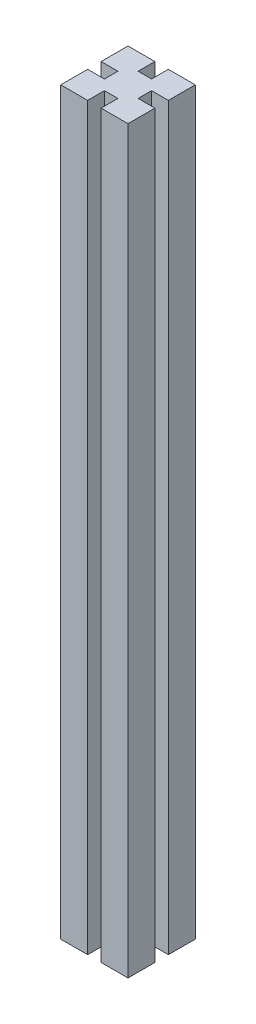
ISO-10303-21;
HEADER;
FILE_DESCRIPTION(('STEP AP214'),'2;1');
FILE_NAME('part.step','',(''),(''),'','','');
FILE_SCHEMA(('AUTOMOTIVE_DESIGN { 1 0 10303 214 1 1 1 1 }'));
ENDSEC;
DATA;
#1=APPLICATION_CONTEXT('core data for automotive mechanical design processes');
#2=APPLICATION_PROTOCOL_DEFINITION('international standard','automotive_design',2000,#1);
#3=PRODUCT_CONTEXT('',#1,'mechanical');
#4=PRODUCT('Part','Part','',(#3));
#5=PRODUCT_RELATED_PRODUCT_CATEGORY('part','',(#4));
#6=PRODUCT_DEFINITION_FORMATION('','',#4);
#7=PRODUCT_DEFINITION_CONTEXT('part definition',#1,'design');
#8=PRODUCT_DEFINITION('design','',#6,#7);
#9=PRODUCT_DEFINITION_SHAPE('','',#8);
#10=(LENGTH_UNIT() NAMED_UNIT(*) SI_UNIT(.MILLI.,.METRE.));
#11=(NAMED_UNIT(*) PLANE_ANGLE_UNIT() SI_UNIT($,.RADIAN.));
#12=(NAMED_UNIT(*) SI_UNIT($,.STERADIAN.) SOLID_ANGLE_UNIT());
#13=UNCERTAINTY_MEASURE_WITH_UNIT(LENGTH_MEASURE(1.E-05),#10,'distance_accuracy_value','');
#14=(GEOMETRIC_REPRESENTATION_CONTEXT(3) GLOBAL_UNCERTAINTY_ASSIGNED_CONTEXT((#13)) GLOBAL_UNIT_ASSIGNED_CONTEXT((#10,
#11,#12)) REPRESENTATION_CONTEXT('',''));
#15=CARTESIAN_POINT('',(0.,0.,0.));
#16=DIRECTION('',(0.,0.,1.));
#17=DIRECTION('',(1.,0.,0.));
#18=AXIS2_PLACEMENT_3D('',#15,#16,#17);
#19=CARTESIAN_POINT('',(5.00000000000001,550.,25.));
#20=DIRECTION('',(0.,0.,-1.));
#21=DIRECTION('',(-1.,0.,0.));
#22=AXIS2_PLACEMENT_3D('',#19,#20,#21);
#23=PLANE('',#22);
#24=DIRECTION('',(1.,0.,0.));
#25=VECTOR('',#24,1.);
#26=CARTESIAN_POINT('',(5.00000000000001,0.,25.));
#27=LINE('',#26,#25);
#28=CARTESIAN_POINT('',(5.00000000000001,0.,25.));
#29=VERTEX_POINT('',#28);
#30=CARTESIAN_POINT('',(25.,0.,25.));
#31=VERTEX_POINT('',#30);
#32=EDGE_CURVE('E199',#29,#31,#27,.T.);
#33=ORIENTED_EDGE('',*,*,#32,.T.);
#34=DIRECTION('',(0.,-1.,0.));
#35=VECTOR('',#34,1.);
#36=CARTESIAN_POINT('',(25.,550.,25.));
#37=LINE('',#36,#35);
#38=CARTESIAN_POINT('',(25.,550.,25.));
#39=VERTEX_POINT('',#38);
#40=EDGE_CURVE('E11',#39,#31,#37,.T.);
#41=ORIENTED_EDGE('',*,*,#40,.F.);
#42=DIRECTION('',(1.,0.,0.));
#43=VECTOR('',#42,1.);
#44=CARTESIAN_POINT('',(5.00000000000001,550.,25.));
#45=LINE('',#44,#43);
#46=CARTESIAN_POINT('',(5.00000000000001,550.,25.));
#47=VERTEX_POINT('',#46);
#48=EDGE_CURVE('E254',#47,#39,#45,.T.);
#49=ORIENTED_EDGE('',*,*,#48,.F.);
#50=DIRECTION('',(0.,-1.,0.));
#51=VECTOR('',#50,1.);
#52=CARTESIAN_POINT('',(5.00000000000001,550.,25.));
#53=LINE('',#52,#51);
#54=EDGE_CURVE('E119',#47,#29,#53,.T.);
#55=ORIENTED_EDGE('',*,*,#54,.T.);
#56=EDGE_LOOP('',(#33,#41,#49,#55));
#57=FACE_BOUND('',#56,.T.);
#58=ADVANCED_FACE('F33',(#57),#23,.F.);
#59=CARTESIAN_POINT('',(25.,550.,5.));
#60=DIRECTION('',(-1.,0.,0.));
#61=DIRECTION('',(0.,0.,1.));
#62=AXIS2_PLACEMENT_3D('',#59,#60,#61);
#63=PLANE('',#62);
#64=DIRECTION('',(0.,0.,-1.));
#65=VECTOR('',#64,1.);
#66=CARTESIAN_POINT('',(25.,0.,5.));
#67=LINE('',#66,#65);
#68=CARTESIAN_POINT('',(25.,0.,5.));
#69=VERTEX_POINT('',#68);
#70=EDGE_CURVE('E201',#31,#69,#67,.T.);
#71=ORIENTED_EDGE('',*,*,#70,.T.);
#72=DIRECTION('',(0.,-1.,0.));
#73=VECTOR('',#72,1.);
#74=CARTESIAN_POINT('',(25.,550.,5.));
#75=LINE('',#74,#73);
#76=CARTESIAN_POINT('',(25.,550.,5.));
#77=VERTEX_POINT('',#76);
#78=EDGE_CURVE('E41',#77,#69,#75,.T.);
#79=ORIENTED_EDGE('',*,*,#78,.F.);
#80=DIRECTION('',(0.,0.,-1.));
#81=VECTOR('',#80,1.);
#82=CARTESIAN_POINT('',(25.,550.,5.));
#83=LINE('',#82,#81);
#84=EDGE_CURVE('E126',#39,#77,#83,.T.);
#85=ORIENTED_EDGE('',*,*,#84,.F.);
#86=ORIENTED_EDGE('',*,*,#40,.T.);
#87=EDGE_LOOP('',(#71,#79,#85,#86));
#88=FACE_BOUND('',#87,.T.);
#89=ADVANCED_FACE('F293',(#88),#63,.F.);
#90=CARTESIAN_POINT('',(25.,550.,5.));
#91=DIRECTION('',(0.,0.,1.));
#92=DIRECTION('',(1.,0.,0.));
#93=AXIS2_PLACEMENT_3D('',#90,#91,#92);
#94=PLANE('',#93);
#95=DIRECTION('',(-1.,0.,0.));
#96=VECTOR('',#95,1.);
#97=CARTESIAN_POINT('',(25.,0.,5.));
#98=LINE('',#97,#96);
#99=CARTESIAN_POINT('',(12.5,0.,5.));
#100=VERTEX_POINT('',#99);
#101=EDGE_CURVE('E204',#69,#100,#98,.T.);
#102=ORIENTED_EDGE('',*,*,#101,.T.);
#103=DIRECTION('',(0.,-1.,0.));
#104=VECTOR('',#103,1.);
#105=CARTESIAN_POINT('',(12.5,550.,5.));
#106=LINE('',#105,#104);
#107=CARTESIAN_POINT('',(12.5,550.,5.));
#108=VERTEX_POINT('',#107);
#109=EDGE_CURVE('E284',#108,#100,#106,.T.);
#110=ORIENTED_EDGE('',*,*,#109,.F.);
#111=DIRECTION('',(-1.,0.,0.));
#112=VECTOR('',#111,1.);
#113=CARTESIAN_POINT('',(25.,550.,5.));
#114=LINE('',#113,#112);
#115=EDGE_CURVE('E291',#77,#108,#114,.T.);
#116=ORIENTED_EDGE('',*,*,#115,.F.);
#117=ORIENTED_EDGE('',*,*,#78,.T.);
#118=EDGE_LOOP('',(#102,#110,#116,#117));
#119=FACE_BOUND('',#118,.T.);
#120=ADVANCED_FACE('F287',(#119),#94,.F.);
#121=CARTESIAN_POINT('',(12.5,550.,-5.));
#122=DIRECTION('',(-1.,0.,0.));
#123=DIRECTION('',(0.,0.,1.));
#124=AXIS2_PLACEMENT_3D('',#121,#122,#123);
#125=PLANE('',#124);
#126=DIRECTION('',(0.,0.,-1.));
#127=VECTOR('',#126,1.);
#128=CARTESIAN_POINT('',(12.5,0.,-5.));
#129=LINE('',#128,#127);
#130=CARTESIAN_POINT('',(12.5,0.,-5.));
#131=VERTEX_POINT('',#130);
#132=EDGE_CURVE('E207',#100,#131,#129,.T.);
#133=ORIENTED_EDGE('',*,*,#132,.T.);
#134=DIRECTION('',(0.,-1.,0.));
#135=VECTOR('',#134,1.);
#136=CARTESIAN_POINT('',(12.5,550.,-5.));
#137=LINE('',#136,#135);
#138=CARTESIAN_POINT('',(12.5,550.,-5.));
#139=VERTEX_POINT('',#138);
#140=EDGE_CURVE('E282',#139,#131,#137,.T.);
#141=ORIENTED_EDGE('',*,*,#140,.F.);
#142=DIRECTION('',(0.,0.,-1.));
#143=VECTOR('',#142,1.);
#144=CARTESIAN_POINT('',(12.5,550.,-5.));
#145=LINE('',#144,#143);
#146=EDGE_CURVE('E305',#108,#139,#145,.T.);
#147=ORIENTED_EDGE('',*,*,#146,.F.);
#148=ORIENTED_EDGE('',*,*,#109,.T.);
#149=EDGE_LOOP('',(#133,#141,#147,#148));
#150=FACE_BOUND('',#149,.T.);
#151=ADVANCED_FACE('F302',(#150),#125,.F.);
#152=CARTESIAN_POINT('',(25.,550.,-5.));
#153=DIRECTION('',(0.,0.,-1.));
#154=DIRECTION('',(-1.,0.,0.));
#155=AXIS2_PLACEMENT_3D('',#152,#153,#154);
#156=PLANE('',#155);
#157=DIRECTION('',(1.,0.,0.));
#158=VECTOR('',#157,1.);
#159=CARTESIAN_POINT('',(25.,0.,-5.));
#160=LINE('',#159,#158);
#161=CARTESIAN_POINT('',(25.,0.,-5.));
#162=VERTEX_POINT('',#161);
#163=EDGE_CURVE('E210',#131,#162,#160,.T.);
#164=ORIENTED_EDGE('',*,*,#163,.T.);
#165=DIRECTION('',(0.,-1.,0.));
#166=VECTOR('',#165,1.);
#167=CARTESIAN_POINT('',(25.,550.,-5.));
#168=LINE('',#167,#166);
#169=CARTESIAN_POINT('',(25.,550.,-5.));
#170=VERTEX_POINT('',#169);
#171=EDGE_CURVE('E280',#170,#162,#168,.T.);
#172=ORIENTED_EDGE('',*,*,#171,.F.);
#173=DIRECTION('',(1.,0.,0.));
#174=VECTOR('',#173,1.);
#175=CARTESIAN_POINT('',(25.,550.,-5.));
#176=LINE('',#175,#174);
#177=EDGE_CURVE('E306',#139,#170,#176,.T.);
#178=ORIENTED_EDGE('',*,*,#177,.F.);
#179=ORIENTED_EDGE('',*,*,#140,.T.);
#180=EDGE_LOOP('',(#164,#172,#178,#179));
#181=FACE_BOUND('',#180,.T.);
#182=ADVANCED_FACE('F357',(#181),#156,.F.);
#183=CARTESIAN_POINT('',(25.,550.,-25.));
#184=DIRECTION('',(-1.,0.,0.));
#185=DIRECTION('',(0.,0.,1.));
#186=AXIS2_PLACEMENT_3D('',#183,#184,#185);
#187=PLANE('',#186);
#188=DIRECTION('',(0.,0.,-1.));
#189=VECTOR('',#188,1.);
#190=CARTESIAN_POINT('',(25.,0.,-25.));
#191=LINE('',#190,#189);
#192=CARTESIAN_POINT('',(25.,0.,-25.));
#193=VERTEX_POINT('',#192);
#194=EDGE_CURVE('E213',#162,#193,#191,.T.);
#195=ORIENTED_EDGE('',*,*,#194,.T.);
#196=DIRECTION('',(0.,-1.,0.));
#197=VECTOR('',#196,1.);
#198=CARTESIAN_POINT('',(25.,550.,-25.));
#199=LINE('',#198,#197);
#200=CARTESIAN_POINT('',(25.,550.,-25.));
#201=VERTEX_POINT('',#200);
#202=EDGE_CURVE('E278',#201,#193,#199,.T.);
#203=ORIENTED_EDGE('',*,*,#202,.F.);
#204=DIRECTION('',(0.,0.,-1.));
#205=VECTOR('',#204,1.);
#206=CARTESIAN_POINT('',(25.,550.,-25.));
#207=LINE('',#206,#205);
#208=EDGE_CURVE('E308',#170,#201,#207,.T.);
#209=ORIENTED_EDGE('',*,*,#208,.F.);
#210=ORIENTED_EDGE('',*,*,#171,.T.);
#211=EDGE_LOOP('',(#195,#203,#209,#210));
#212=FACE_BOUND('',#211,.T.);
#213=ADVANCED_FACE('F360',(#212),#187,.F.);
#214=CARTESIAN_POINT('',(5.00000000000001,550.,-25.));
#215=DIRECTION('',(0.,0.,1.));
#216=DIRECTION('',(1.,0.,0.));
#217=AXIS2_PLACEMENT_3D('',#214,#215,#216);
#218=PLANE('',#217);
#219=DIRECTION('',(-1.,0.,0.));
#220=VECTOR('',#219,1.);
#221=CARTESIAN_POINT('',(5.00000000000001,0.,-25.));
#222=LINE('',#221,#220);
#223=CARTESIAN_POINT('',(5.00000000000001,0.,-25.));
#224=VERTEX_POINT('',#223);
#225=EDGE_CURVE('E216',#193,#224,#222,.T.);
#226=ORIENTED_EDGE('',*,*,#225,.T.);
#227=DIRECTION('',(0.,-1.,0.));
#228=VECTOR('',#227,1.);
#229=CARTESIAN_POINT('',(5.00000000000001,550.,-25.));
#230=LINE('',#229,#228);
#231=CARTESIAN_POINT('',(5.00000000000001,550.,-25.));
#232=VERTEX_POINT('',#231);
#233=EDGE_CURVE('E276',#232,#224,#230,.T.);
#234=ORIENTED_EDGE('',*,*,#233,.F.);
#235=DIRECTION('',(-1.,0.,0.));
#236=VECTOR('',#235,1.);
#237=CARTESIAN_POINT('',(5.00000000000001,550.,-25.));
#238=LINE('',#237,#236);
#239=EDGE_CURVE('E314',#201,#232,#238,.T.);
#240=ORIENTED_EDGE('',*,*,#239,.F.);
#241=ORIENTED_EDGE('',*,*,#202,.T.);
#242=EDGE_LOOP('',(#226,#234,#240,#241));
#243=FACE_BOUND('',#242,.T.);
#244=ADVANCED_FACE('F364',(#243),#218,.F.);
#245=CARTESIAN_POINT('',(5.00000000000001,550.,-25.));
#246=DIRECTION('',(1.,0.,0.));
#247=DIRECTION('',(0.,0.,-1.));
#248=AXIS2_PLACEMENT_3D('',#245,#246,#247);
#249=PLANE('',#248);
#250=DIRECTION('',(0.,0.,1.));
#251=VECTOR('',#250,1.);
#252=CARTESIAN_POINT('',(5.00000000000001,0.,-25.));
#253=LINE('',#252,#251);
#254=CARTESIAN_POINT('',(5.,0.,-12.5));
#255=VERTEX_POINT('',#254);
#256=EDGE_CURVE('E219',#224,#255,#253,.T.);
#257=ORIENTED_EDGE('',*,*,#256,.T.);
#258=DIRECTION('',(0.,-1.,0.));
#259=VECTOR('',#258,1.);
#260=CARTESIAN_POINT('',(5.,550.,-12.5));
#261=LINE('',#260,#259);
#262=CARTESIAN_POINT('',(5.,550.,-12.5));
#263=VERTEX_POINT('',#262);
#264=EDGE_CURVE('E274',#263,#255,#261,.T.);
#265=ORIENTED_EDGE('',*,*,#264,.F.);
#266=DIRECTION('',(0.,0.,1.));
#267=VECTOR('',#266,1.);
#268=CARTESIAN_POINT('',(5.00000000000001,550.,-25.));
#269=LINE('',#268,#267);
#270=EDGE_CURVE('E316',#232,#263,#269,.T.);
#271=ORIENTED_EDGE('',*,*,#270,.F.);
#272=ORIENTED_EDGE('',*,*,#233,.T.);
#273=EDGE_LOOP('',(#257,#265,#271,#272));
#274=FACE_BOUND('',#273,.T.);
#275=ADVANCED_FACE('F368',(#274),#249,.F.);
#276=CARTESIAN_POINT('',(-5.,550.,-12.5));
#277=DIRECTION('',(0.,0.,1.));
#278=DIRECTION('',(1.,0.,0.));
#279=AXIS2_PLACEMENT_3D('',#276,#277,#278);
#280=PLANE('',#279);
#281=DIRECTION('',(-1.,0.,0.));
#282=VECTOR('',#281,1.);
#283=CARTESIAN_POINT('',(-5.,0.,-12.5));
#284=LINE('',#283,#282);
#285=CARTESIAN_POINT('',(-5.,0.,-12.5));
#286=VERTEX_POINT('',#285);
#287=EDGE_CURVE('E222',#255,#286,#284,.T.);
#288=ORIENTED_EDGE('',*,*,#287,.T.);
#289=DIRECTION('',(0.,-1.,0.));
#290=VECTOR('',#289,1.);
#291=CARTESIAN_POINT('',(-5.,550.,-12.5));
#292=LINE('',#291,#290);
#293=CARTESIAN_POINT('',(-5.,550.,-12.5));
#294=VERTEX_POINT('',#293);
#295=EDGE_CURVE('E272',#294,#286,#292,.T.);
#296=ORIENTED_EDGE('',*,*,#295,.F.);
#297=DIRECTION('',(-1.,0.,0.));
#298=VECTOR('',#297,1.);
#299=CARTESIAN_POINT('',(-5.,550.,-12.5));
#300=LINE('',#299,#298);
#301=EDGE_CURVE('E318',#263,#294,#300,.T.);
#302=ORIENTED_EDGE('',*,*,#301,.F.);
#303=ORIENTED_EDGE('',*,*,#264,.T.);
#304=EDGE_LOOP('',(#288,#296,#302,#303));
#305=FACE_BOUND('',#304,.T.);
#306=ADVANCED_FACE('F372',(#305),#280,.F.);
#307=CARTESIAN_POINT('',(-5.,550.,-25.));
#308=DIRECTION('',(-1.,0.,0.));
#309=DIRECTION('',(0.,0.,1.));
#310=AXIS2_PLACEMENT_3D('',#307,#308,#309);
#311=PLANE('',#310);
#312=DIRECTION('',(0.,0.,-1.));
#313=VECTOR('',#312,1.);
#314=CARTESIAN_POINT('',(-5.,0.,-25.));
#315=LINE('',#314,#313);
#316=CARTESIAN_POINT('',(-5.,0.,-25.));
#317=VERTEX_POINT('',#316);
#318=EDGE_CURVE('E225',#286,#317,#315,.T.);
#319=ORIENTED_EDGE('',*,*,#318,.T.);
#320=DIRECTION('',(0.,-1.,0.));
#321=VECTOR('',#320,1.);
#322=CARTESIAN_POINT('',(-5.,550.,-25.));
#323=LINE('',#322,#321);
#324=CARTESIAN_POINT('',(-5.,550.,-25.));
#325=VERTEX_POINT('',#324);
#326=EDGE_CURVE('E270',#325,#317,#323,.T.);
#327=ORIENTED_EDGE('',*,*,#326,.F.);
#328=DIRECTION('',(0.,0.,-1.));
#329=VECTOR('',#328,1.);
#330=CARTESIAN_POINT('',(-5.,550.,-25.));
#331=LINE('',#330,#329);
#332=EDGE_CURVE('E320',#294,#325,#331,.T.);
#333=ORIENTED_EDGE('',*,*,#332,.F.);
#334=ORIENTED_EDGE('',*,*,#295,.T.);
#335=EDGE_LOOP('',(#319,#327,#333,#334));
#336=FACE_BOUND('',#335,.T.);
#337=ADVANCED_FACE('F376',(#336),#311,.F.);
#338=CARTESIAN_POINT('',(-25.,550.,-25.));
#339=DIRECTION('',(0.,0.,1.));
#340=DIRECTION('',(1.,0.,0.));
#341=AXIS2_PLACEMENT_3D('',#338,#339,#340);
#342=PLANE('',#341);
#343=DIRECTION('',(-1.,0.,0.));
#344=VECTOR('',#343,1.);
#345=CARTESIAN_POINT('',(-25.,0.,-25.));
#346=LINE('',#345,#344);
#347=CARTESIAN_POINT('',(-25.,0.,-25.));
#348=VERTEX_POINT('',#347);
#349=EDGE_CURVE('E228',#317,#348,#346,.T.);
#350=ORIENTED_EDGE('',*,*,#349,.T.);
#351=DIRECTION('',(0.,-1.,0.));
#352=VECTOR('',#351,1.);
#353=CARTESIAN_POINT('',(-25.,550.,-25.));
#354=LINE('',#353,#352);
#355=CARTESIAN_POINT('',(-25.,550.,-25.));
#356=VERTEX_POINT('',#355);
#357=EDGE_CURVE('E268',#356,#348,#354,.T.);
#358=ORIENTED_EDGE('',*,*,#357,.F.);
#359=DIRECTION('',(-1.,0.,0.));
#360=VECTOR('',#359,1.);
#361=CARTESIAN_POINT('',(-25.,550.,-25.));
#362=LINE('',#361,#360);
#363=EDGE_CURVE('E322',#325,#356,#362,.T.);
#364=ORIENTED_EDGE('',*,*,#363,.F.);
#365=ORIENTED_EDGE('',*,*,#326,.T.);
#366=EDGE_LOOP('',(#350,#358,#364,#365));
#367=FACE_BOUND('',#366,.T.);
#368=ADVANCED_FACE('F380',(#367),#342,.F.);
#369=CARTESIAN_POINT('',(-25.,550.,-25.));
#370=DIRECTION('',(1.,0.,0.));
#371=DIRECTION('',(0.,0.,-1.));
#372=AXIS2_PLACEMENT_3D('',#369,#370,#371);
#373=PLANE('',#372);
#374=DIRECTION('',(0.,0.,1.));
#375=VECTOR('',#374,1.);
#376=CARTESIAN_POINT('',(-25.,0.,-25.));
#377=LINE('',#376,#375);
#378=CARTESIAN_POINT('',(-25.,0.,-4.99999999999999));
#379=VERTEX_POINT('',#378);
#380=EDGE_CURVE('E231',#348,#379,#377,.T.);
#381=ORIENTED_EDGE('',*,*,#380,.T.);
#382=DIRECTION('',(0.,-1.,0.));
#383=VECTOR('',#382,1.);
#384=CARTESIAN_POINT('',(-25.,550.,-4.99999999999999));
#385=LINE('',#384,#383);
#386=CARTESIAN_POINT('',(-25.,550.,-4.99999999999999));
#387=VERTEX_POINT('',#386);
#388=EDGE_CURVE('E266',#387,#379,#385,.T.);
#389=ORIENTED_EDGE('',*,*,#388,.F.);
#390=DIRECTION('',(0.,0.,1.));
#391=VECTOR('',#390,1.);
#392=CARTESIAN_POINT('',(-25.,550.,-25.));
#393=LINE('',#392,#391);
#394=EDGE_CURVE('E324',#356,#387,#393,.T.);
#395=ORIENTED_EDGE('',*,*,#394,.F.);
#396=ORIENTED_EDGE('',*,*,#357,.T.);
#397=EDGE_LOOP('',(#381,#389,#395,#396));
#398=FACE_BOUND('',#397,.T.);
#399=ADVANCED_FACE('F384',(#398),#373,.F.);
#400=CARTESIAN_POINT('',(-25.,550.,-4.99999999999999));
#401=DIRECTION('',(0.,0.,-1.));
#402=DIRECTION('',(-1.,0.,0.));
#403=AXIS2_PLACEMENT_3D('',#400,#401,#402);
#404=PLANE('',#403);
#405=DIRECTION('',(1.,0.,0.));
#406=VECTOR('',#405,1.);
#407=CARTESIAN_POINT('',(-25.,0.,-4.99999999999999));
#408=LINE('',#407,#406);
#409=CARTESIAN_POINT('',(-12.5,0.,-5.));
#410=VERTEX_POINT('',#409);
#411=EDGE_CURVE('E234',#379,#410,#408,.T.);
#412=ORIENTED_EDGE('',*,*,#411,.T.);
#413=DIRECTION('',(0.,-1.,0.));
#414=VECTOR('',#413,1.);
#415=CARTESIAN_POINT('',(-12.5,550.,-5.));
#416=LINE('',#415,#414);
#417=CARTESIAN_POINT('',(-12.5,550.,-5.));
#418=VERTEX_POINT('',#417);
#419=EDGE_CURVE('E264',#418,#410,#416,.T.);
#420=ORIENTED_EDGE('',*,*,#419,.F.);
#421=DIRECTION('',(1.,0.,0.));
#422=VECTOR('',#421,1.);
#423=CARTESIAN_POINT('',(-25.,550.,-4.99999999999999));
#424=LINE('',#423,#422);
#425=EDGE_CURVE('E326',#387,#418,#424,.T.);
#426=ORIENTED_EDGE('',*,*,#425,.F.);
#427=ORIENTED_EDGE('',*,*,#388,.T.);
#428=EDGE_LOOP('',(#412,#420,#426,#427));
#429=FACE_BOUND('',#428,.T.);
#430=ADVANCED_FACE('F388',(#429),#404,.F.);
#431=CARTESIAN_POINT('',(-12.5,550.,-5.));
#432=DIRECTION('',(1.,0.,0.));
#433=DIRECTION('',(0.,0.,-1.));
#434=AXIS2_PLACEMENT_3D('',#431,#432,#433);
#435=PLANE('',#434);
#436=DIRECTION('',(0.,0.,1.));
#437=VECTOR('',#436,1.);
#438=CARTESIAN_POINT('',(-12.5,0.,-5.));
#439=LINE('',#438,#437);
#440=CARTESIAN_POINT('',(-12.5,0.,5.));
#441=VERTEX_POINT('',#440);
#442=EDGE_CURVE('E237',#410,#441,#439,.T.);
#443=ORIENTED_EDGE('',*,*,#442,.T.);
#444=DIRECTION('',(0.,-1.,0.));
#445=VECTOR('',#444,1.);
#446=CARTESIAN_POINT('',(-12.5,550.,5.));
#447=LINE('',#446,#445);
#448=CARTESIAN_POINT('',(-12.5,550.,5.));
#449=VERTEX_POINT('',#448);
#450=EDGE_CURVE('E262',#449,#441,#447,.T.);
#451=ORIENTED_EDGE('',*,*,#450,.F.);
#452=DIRECTION('',(0.,0.,1.));
#453=VECTOR('',#452,1.);
#454=CARTESIAN_POINT('',(-12.5,550.,-5.));
#455=LINE('',#454,#453);
#456=EDGE_CURVE('E328',#418,#449,#455,.T.);
#457=ORIENTED_EDGE('',*,*,#456,.F.);
#458=ORIENTED_EDGE('',*,*,#419,.T.);
#459=EDGE_LOOP('',(#443,#451,#457,#458));
#460=FACE_BOUND('',#459,.T.);
#461=ADVANCED_FACE('F392',(#460),#435,.F.);
#462=CARTESIAN_POINT('',(-25.,550.,5.00000000000001));
#463=DIRECTION('',(0.,0.,1.));
#464=DIRECTION('',(1.,0.,0.));
#465=AXIS2_PLACEMENT_3D('',#462,#463,#464);
#466=PLANE('',#465);
#467=DIRECTION('',(-1.,0.,0.));
#468=VECTOR('',#467,1.);
#469=CARTESIAN_POINT('',(-25.,0.,5.00000000000001));
#470=LINE('',#469,#468);
#471=CARTESIAN_POINT('',(-25.,0.,5.00000000000001));
#472=VERTEX_POINT('',#471);
#473=EDGE_CURVE('E240',#441,#472,#470,.T.);
#474=ORIENTED_EDGE('',*,*,#473,.T.);
#475=DIRECTION('',(0.,-1.,0.));
#476=VECTOR('',#475,1.);
#477=CARTESIAN_POINT('',(-25.,550.,5.00000000000001));
#478=LINE('',#477,#476);
#479=CARTESIAN_POINT('',(-25.,550.,5.00000000000001));
#480=VERTEX_POINT('',#479);
#481=EDGE_CURVE('E260',#480,#472,#478,.T.);
#482=ORIENTED_EDGE('',*,*,#481,.F.);
#483=DIRECTION('',(-1.,0.,0.));
#484=VECTOR('',#483,1.);
#485=CARTESIAN_POINT('',(-25.,550.,5.00000000000001));
#486=LINE('',#485,#484);
#487=EDGE_CURVE('E330',#449,#480,#486,.T.);
#488=ORIENTED_EDGE('',*,*,#487,.F.);
#489=ORIENTED_EDGE('',*,*,#450,.T.);
#490=EDGE_LOOP('',(#474,#482,#488,#489));
#491=FACE_BOUND('',#490,.T.);
#492=ADVANCED_FACE('F396',(#491),#466,.F.);
#493=CARTESIAN_POINT('',(-25.,550.,5.00000000000001));
#494=DIRECTION('',(1.,0.,0.));
#495=DIRECTION('',(0.,0.,-1.));
#496=AXIS2_PLACEMENT_3D('',#493,#494,#495);
#497=PLANE('',#496);
#498=DIRECTION('',(0.,0.,1.));
#499=VECTOR('',#498,1.);
#500=CARTESIAN_POINT('',(-25.,0.,5.00000000000001));
#501=LINE('',#500,#499);
#502=CARTESIAN_POINT('',(-25.,0.,25.));
#503=VERTEX_POINT('',#502);
#504=EDGE_CURVE('E243',#472,#503,#501,.T.);
#505=ORIENTED_EDGE('',*,*,#504,.T.);
#506=DIRECTION('',(0.,-1.,0.));
#507=VECTOR('',#506,1.);
#508=CARTESIAN_POINT('',(-25.,550.,25.));
#509=LINE('',#508,#507);
#510=CARTESIAN_POINT('',(-25.,550.,25.));
#511=VERTEX_POINT('',#510);
#512=EDGE_CURVE('E258',#511,#503,#509,.T.);
#513=ORIENTED_EDGE('',*,*,#512,.F.);
#514=DIRECTION('',(0.,0.,1.));
#515=VECTOR('',#514,1.);
#516=CARTESIAN_POINT('',(-25.,550.,5.00000000000001));
#517=LINE('',#516,#515);
#518=EDGE_CURVE('E332',#480,#511,#517,.T.);
#519=ORIENTED_EDGE('',*,*,#518,.F.);
#520=ORIENTED_EDGE('',*,*,#481,.T.);
#521=EDGE_LOOP('',(#505,#513,#519,#520));
#522=FACE_BOUND('',#521,.T.);
#523=ADVANCED_FACE('F338',(#522),#497,.F.);
#524=CARTESIAN_POINT('',(-25.,550.,25.));
#525=DIRECTION('',(0.,0.,-1.));
#526=DIRECTION('',(-1.,0.,0.));
#527=AXIS2_PLACEMENT_3D('',#524,#525,#526);
#528=PLANE('',#527);
#529=DIRECTION('',(1.,0.,0.));
#530=VECTOR('',#529,1.);
#531=CARTESIAN_POINT('',(-25.,0.,25.));
#532=LINE('',#531,#530);
#533=CARTESIAN_POINT('',(-5.,0.,25.));
#534=VERTEX_POINT('',#533);
#535=EDGE_CURVE('E246',#503,#534,#532,.T.);
#536=ORIENTED_EDGE('',*,*,#535,.T.);
#537=DIRECTION('',(0.,-1.,0.));
#538=VECTOR('',#537,1.);
#539=CARTESIAN_POINT('',(-5.,550.,25.));
#540=LINE('',#539,#538);
#541=CARTESIAN_POINT('',(-5.,550.,25.));
#542=VERTEX_POINT('',#541);
#543=EDGE_CURVE('E192',#542,#534,#540,.T.);
#544=ORIENTED_EDGE('',*,*,#543,.F.);
#545=DIRECTION('',(1.,0.,0.));
#546=VECTOR('',#545,1.);
#547=CARTESIAN_POINT('',(-25.,550.,25.));
#548=LINE('',#547,#546);
#549=EDGE_CURVE('E181',#511,#542,#548,.T.);
#550=ORIENTED_EDGE('',*,*,#549,.F.);
#551=ORIENTED_EDGE('',*,*,#512,.T.);
#552=EDGE_LOOP('',(#536,#544,#550,#551));
#553=FACE_BOUND('',#552,.T.);
#554=ADVANCED_FACE('F342',(#553),#528,.F.);
#555=CARTESIAN_POINT('',(-5.,550.,25.));
#556=DIRECTION('',(-1.,0.,0.));
#557=DIRECTION('',(0.,0.,1.));
#558=AXIS2_PLACEMENT_3D('',#555,#556,#557);
#559=PLANE('',#558);
#560=DIRECTION('',(0.,0.,-1.));
#561=VECTOR('',#560,1.);
#562=CARTESIAN_POINT('',(-5.,0.,25.));
#563=LINE('',#562,#561);
#564=CARTESIAN_POINT('',(-5.,0.,12.5));
#565=VERTEX_POINT('',#564);
#566=EDGE_CURVE('E189',#534,#565,#563,.T.);
#567=ORIENTED_EDGE('',*,*,#566,.T.);
#568=DIRECTION('',(0.,-1.,0.));
#569=VECTOR('',#568,1.);
#570=CARTESIAN_POINT('',(-5.,550.,12.5));
#571=LINE('',#570,#569);
#572=CARTESIAN_POINT('',(-5.,550.,12.5));
#573=VERTEX_POINT('',#572);
#574=EDGE_CURVE('E186',#573,#565,#571,.T.);
#575=ORIENTED_EDGE('',*,*,#574,.F.);
#576=DIRECTION('',(0.,0.,-1.));
#577=VECTOR('',#576,1.);
#578=CARTESIAN_POINT('',(-5.,550.,25.));
#579=LINE('',#578,#577);
#580=EDGE_CURVE('E175',#542,#573,#579,.T.);
#581=ORIENTED_EDGE('',*,*,#580,.F.);
#582=ORIENTED_EDGE('',*,*,#543,.T.);
#583=EDGE_LOOP('',(#567,#575,#581,#582));
#584=FACE_BOUND('',#583,.T.);
#585=ADVANCED_FACE('F187',(#584),#559,.F.);
#586=CARTESIAN_POINT('',(-5.,550.,12.5));
#587=DIRECTION('',(0.,0.,-1.));
#588=DIRECTION('',(-1.,0.,0.));
#589=AXIS2_PLACEMENT_3D('',#586,#587,#588);
#590=PLANE('',#589);
#591=DIRECTION('',(1.,0.,0.));
#592=VECTOR('',#591,1.);
#593=CARTESIAN_POINT('',(-5.,0.,12.5));
#594=LINE('',#593,#592);
#595=CARTESIAN_POINT('',(5.,0.,12.5));
#596=VERTEX_POINT('',#595);
#597=EDGE_CURVE('E250',#565,#596,#594,.T.);
#598=ORIENTED_EDGE('',*,*,#597,.T.);
#599=DIRECTION('',(0.,-1.,0.));
#600=VECTOR('',#599,1.);
#601=CARTESIAN_POINT('',(5.,550.,12.5));
#602=LINE('',#601,#600);
#603=CARTESIAN_POINT('',(5.,550.,12.5));
#604=VERTEX_POINT('',#603);
#605=EDGE_CURVE('E112',#604,#596,#602,.T.);
#606=ORIENTED_EDGE('',*,*,#605,.F.);
#607=DIRECTION('',(1.,0.,0.));
#608=VECTOR('',#607,1.);
#609=CARTESIAN_POINT('',(-5.,550.,12.5));
#610=LINE('',#609,#608);
#611=EDGE_CURVE('E179',#573,#604,#610,.T.);
#612=ORIENTED_EDGE('',*,*,#611,.F.);
#613=ORIENTED_EDGE('',*,*,#574,.T.);
#614=EDGE_LOOP('',(#598,#606,#612,#613));
#615=FACE_BOUND('',#614,.T.);
#616=ADVANCED_FACE('F194',(#615),#590,.F.);
#617=CARTESIAN_POINT('',(5.00000000000001,550.,25.));
#618=DIRECTION('',(1.,0.,0.));
#619=DIRECTION('',(0.,0.,-1.));
#620=AXIS2_PLACEMENT_3D('',#617,#618,#619);
#621=PLANE('',#620);
#622=DIRECTION('',(0.,0.,1.));
#623=VECTOR('',#622,1.);
#624=CARTESIAN_POINT('',(5.00000000000001,0.,25.));
#625=LINE('',#624,#623);
#626=EDGE_CURVE('E252',#596,#29,#625,.T.);
#627=ORIENTED_EDGE('',*,*,#626,.T.);
#628=ORIENTED_EDGE('',*,*,#54,.F.);
#629=DIRECTION('',(0.,0.,1.));
#630=VECTOR('',#629,1.);
#631=CARTESIAN_POINT('',(5.00000000000001,550.,25.));
#632=LINE('',#631,#630);
#633=EDGE_CURVE('E49',#604,#47,#632,.T.);
#634=ORIENTED_EDGE('',*,*,#633,.F.);
#635=ORIENTED_EDGE('',*,*,#605,.T.);
#636=EDGE_LOOP('',(#627,#628,#634,#635));
#637=FACE_BOUND('',#636,.T.);
#638=ADVANCED_FACE('F344',(#637),#621,.F.);
#639=CARTESIAN_POINT('',(0.,550.,0.));
#640=DIRECTION('',(0.,-1.,0.));
#641=DIRECTION('',(0.,0.,-1.));
#642=AXIS2_PLACEMENT_3D('',#639,#640,#641);
#643=PLANE('',#642);
#644=ORIENTED_EDGE('',*,*,#48,.T.);
#645=ORIENTED_EDGE('',*,*,#84,.T.);
#646=ORIENTED_EDGE('',*,*,#115,.T.);
#647=ORIENTED_EDGE('',*,*,#146,.T.);
#648=ORIENTED_EDGE('',*,*,#177,.T.);
#649=ORIENTED_EDGE('',*,*,#208,.T.);
#650=ORIENTED_EDGE('',*,*,#239,.T.);
#651=ORIENTED_EDGE('',*,*,#270,.T.);
#652=ORIENTED_EDGE('',*,*,#301,.T.);
#653=ORIENTED_EDGE('',*,*,#332,.T.);
#654=ORIENTED_EDGE('',*,*,#363,.T.);
#655=ORIENTED_EDGE('',*,*,#394,.T.);
#656=ORIENTED_EDGE('',*,*,#425,.T.);
#657=ORIENTED_EDGE('',*,*,#456,.T.);
#658=ORIENTED_EDGE('',*,*,#487,.T.);
#659=ORIENTED_EDGE('',*,*,#518,.T.);
#660=ORIENTED_EDGE('',*,*,#549,.T.);
#661=ORIENTED_EDGE('',*,*,#580,.T.);
#662=ORIENTED_EDGE('',*,*,#611,.T.);
#663=ORIENTED_EDGE('',*,*,#633,.T.);
#664=EDGE_LOOP('',(#644,#645,#646,#647,#648,#649,#650,#651,#652,#653,#654,#655,#656,#657,#658,
#659,#660,#661,#662,#663));
#665=FACE_BOUND('',#664,.T.);
#666=ADVANCED_FACE('F177',(#665),#643,.F.);
#667=CARTESIAN_POINT('',(0.,0.,0.));
#668=DIRECTION('',(0.,-1.,0.));
#669=DIRECTION('',(0.,0.,-1.));
#670=AXIS2_PLACEMENT_3D('',#667,#668,#669);
#671=PLANE('',#670);
#672=ORIENTED_EDGE('',*,*,#32,.F.);
#673=ORIENTED_EDGE('',*,*,#626,.F.);
#674=ORIENTED_EDGE('',*,*,#597,.F.);
#675=ORIENTED_EDGE('',*,*,#566,.F.);
#676=ORIENTED_EDGE('',*,*,#535,.F.);
#677=ORIENTED_EDGE('',*,*,#504,.F.);
#678=ORIENTED_EDGE('',*,*,#473,.F.);
#679=ORIENTED_EDGE('',*,*,#442,.F.);
#680=ORIENTED_EDGE('',*,*,#411,.F.);
#681=ORIENTED_EDGE('',*,*,#380,.F.);
#682=ORIENTED_EDGE('',*,*,#349,.F.);
#683=ORIENTED_EDGE('',*,*,#318,.F.);
#684=ORIENTED_EDGE('',*,*,#287,.F.);
#685=ORIENTED_EDGE('',*,*,#256,.F.);
#686=ORIENTED_EDGE('',*,*,#225,.F.);
#687=ORIENTED_EDGE('',*,*,#194,.F.);
#688=ORIENTED_EDGE('',*,*,#163,.F.);
#689=ORIENTED_EDGE('',*,*,#132,.F.);
#690=ORIENTED_EDGE('',*,*,#101,.F.);
#691=ORIENTED_EDGE('',*,*,#70,.F.);
#692=EDGE_LOOP('',(#672,#673,#674,#675,#676,#677,#678,#679,#680,#681,#682,#683,#684,#685,#686,
#687,#688,#689,#690,#691));
#693=FACE_BOUND('',#692,.T.);
#694=ADVANCED_FACE('F297',(#693),#671,.T.);
#695=CLOSED_SHELL('',(#58,#89,#120,#151,#182,#213,#244,#275,#306,#337,#368,#399,#430,#461,#492,
#523,#554,#585,#616,#638,#666,#694));
#696=MANIFOLD_SOLID_BREP('B2',#695);
#697=ADVANCED_BREP_SHAPE_REPRESENTATION('',(#18,#696),#14);
#698=SHAPE_DEFINITION_REPRESENTATION(#9,#697);
ENDSEC;
END-ISO-10303-21;
